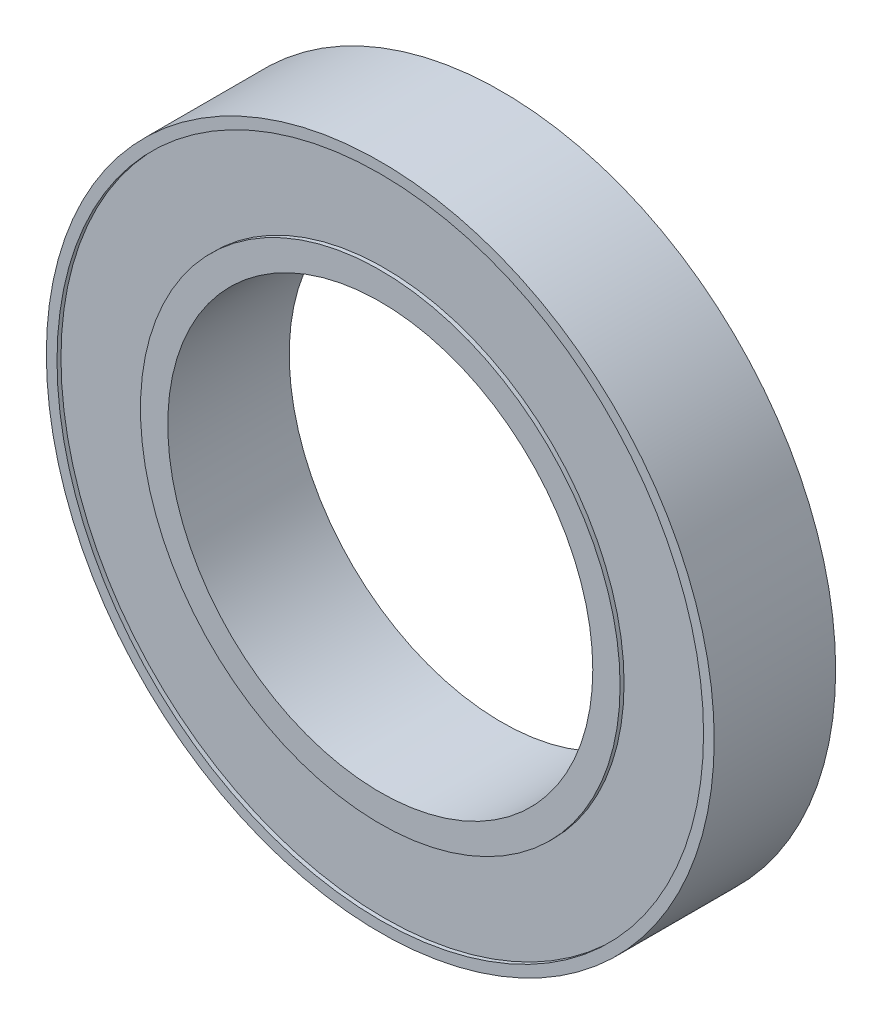
ISO-10303-21;
HEADER;
FILE_DESCRIPTION(('STEP AP214'),'2;1');
FILE_NAME('part.step','',(''),(''),'','','');
FILE_SCHEMA(('AUTOMOTIVE_DESIGN { 1 0 10303 214 1 1 1 1 }'));
ENDSEC;
DATA;
#1=APPLICATION_CONTEXT('core data for automotive mechanical design processes');
#2=APPLICATION_PROTOCOL_DEFINITION('international standard','automotive_design',2000,#1);
#3=PRODUCT_CONTEXT('',#1,'mechanical');
#4=PRODUCT('Part','Part','',(#3));
#5=PRODUCT_RELATED_PRODUCT_CATEGORY('part','',(#4));
#6=PRODUCT_DEFINITION_FORMATION('','',#4);
#7=PRODUCT_DEFINITION_CONTEXT('part definition',#1,'design');
#8=PRODUCT_DEFINITION('design','',#6,#7);
#9=PRODUCT_DEFINITION_SHAPE('','',#8);
#10=(LENGTH_UNIT() NAMED_UNIT(*) SI_UNIT(.MILLI.,.METRE.));
#11=(NAMED_UNIT(*) PLANE_ANGLE_UNIT() SI_UNIT($,.RADIAN.));
#12=(NAMED_UNIT(*) SI_UNIT($,.STERADIAN.) SOLID_ANGLE_UNIT());
#13=UNCERTAINTY_MEASURE_WITH_UNIT(LENGTH_MEASURE(1.E-05),#10,'distance_accuracy_value','');
#14=(GEOMETRIC_REPRESENTATION_CONTEXT(3) GLOBAL_UNCERTAINTY_ASSIGNED_CONTEXT((#13)) GLOBAL_UNIT_ASSIGNED_CONTEXT((#10,
#11,#12)) REPRESENTATION_CONTEXT('',''));
#15=CARTESIAN_POINT('',(0.,0.,0.));
#16=DIRECTION('',(0.,0.,1.));
#17=DIRECTION('',(1.,0.,0.));
#18=AXIS2_PLACEMENT_3D('',#15,#16,#17);
#19=CARTESIAN_POINT('',(17.5,0.,-5.));
#20=DIRECTION('',(0.,0.,-1.));
#21=DIRECTION('',(-1.,0.,0.));
#22=AXIS2_PLACEMENT_3D('',#19,#20,#21);
#23=PLANE('',#22);
#24=CARTESIAN_POINT('',(0.,0.,-5.));
#25=DIRECTION('',(0.,0.,1.));
#26=DIRECTION('',(1.,0.,0.));
#27=AXIS2_PLACEMENT_3D('',#24,#25,#26);
#28=CIRCLE('',#27,17.5);
#29=CARTESIAN_POINT('',(17.5,0.,-5.));
#30=VERTEX_POINT('',#29);
#31=EDGE_CURVE('E85',#30,#30,#28,.T.);
#32=ORIENTED_EDGE('',*,*,#31,.T.);
#33=EDGE_LOOP('',(#32));
#34=FACE_BOUND('',#33,.T.);
#35=CARTESIAN_POINT('',(0.,0.,-5.));
#36=DIRECTION('',(0.,0.,1.));
#37=DIRECTION('',(1.,0.,0.));
#38=AXIS2_PLACEMENT_3D('',#35,#36,#37);
#39=CIRCLE('',#38,19.7490722316571);
#40=CARTESIAN_POINT('',(19.7490722316571,0.,-5.));
#41=VERTEX_POINT('',#40);
#42=EDGE_CURVE('E10',#41,#41,#39,.T.);
#43=ORIENTED_EDGE('',*,*,#42,.F.);
#44=EDGE_LOOP('',(#43));
#45=FACE_BOUND('',#44,.T.);
#46=ADVANCED_FACE('F37',(#34,#45),#23,.T.);
#47=CARTESIAN_POINT('',(0.,0.,0.));
#48=DIRECTION('',(0.,0.,1.));
#49=DIRECTION('',(1.,0.,0.));
#50=AXIS2_PLACEMENT_3D('',#47,#48,#49);
#51=CYLINDRICAL_SURFACE('',#50,19.7490722316571);
#52=ORIENTED_EDGE('',*,*,#42,.T.);
#53=EDGE_LOOP('',(#52));
#54=FACE_BOUND('',#53,.T.);
#55=CARTESIAN_POINT('',(0.,0.,-4.6729794233355));
#56=DIRECTION('',(0.,0.,1.));
#57=DIRECTION('',(1.,0.,0.));
#58=AXIS2_PLACEMENT_3D('',#55,#56,#57);
#59=CIRCLE('',#58,19.7490722316571);
#60=CARTESIAN_POINT('',(19.7490722316571,0.,-4.6729794233355));
#61=VERTEX_POINT('',#60);
#62=EDGE_CURVE('E43',#61,#61,#59,.T.);
#63=ORIENTED_EDGE('',*,*,#62,.F.);
#64=EDGE_LOOP('',(#63));
#65=FACE_BOUND('',#64,.T.);
#66=ADVANCED_FACE('F105',(#54,#65),#51,.T.);
#67=CARTESIAN_POINT('',(19.7490722316571,0.,-4.6729794233355));
#68=DIRECTION('',(0.,0.,-1.));
#69=DIRECTION('',(-1.,0.,0.));
#70=AXIS2_PLACEMENT_3D('',#67,#68,#69);
#71=PLANE('',#70);
#72=ORIENTED_EDGE('',*,*,#62,.T.);
#73=EDGE_LOOP('',(#72));
#74=FACE_BOUND('',#73,.T.);
#75=CARTESIAN_POINT('',(0.,0.,-4.6729794233355));
#76=DIRECTION('',(0.,0.,1.));
#77=DIRECTION('',(1.,0.,0.));
#78=AXIS2_PLACEMENT_3D('',#75,#76,#77);
#79=CIRCLE('',#78,26.6210192290424);
#80=CARTESIAN_POINT('',(26.6210192290424,0.,-4.6729794233355));
#81=VERTEX_POINT('',#80);
#82=EDGE_CURVE('E47',#81,#81,#79,.T.);
#83=ORIENTED_EDGE('',*,*,#82,.F.);
#84=EDGE_LOOP('',(#83));
#85=FACE_BOUND('',#84,.T.);
#86=ADVANCED_FACE('F109',(#74,#85),#71,.T.);
#87=CARTESIAN_POINT('',(0.,0.,0.));
#88=DIRECTION('',(0.,0.,1.));
#89=DIRECTION('',(1.,0.,0.));
#90=AXIS2_PLACEMENT_3D('',#87,#88,#89);
#91=CYLINDRICAL_SURFACE('',#90,26.6210192290424);
#92=ORIENTED_EDGE('',*,*,#82,.T.);
#93=EDGE_LOOP('',(#92));
#94=FACE_BOUND('',#93,.T.);
#95=CARTESIAN_POINT('',(0.,0.,-5.));
#96=DIRECTION('',(0.,0.,1.));
#97=DIRECTION('',(1.,0.,0.));
#98=AXIS2_PLACEMENT_3D('',#95,#96,#97);
#99=CIRCLE('',#98,26.6210192290424);
#100=CARTESIAN_POINT('',(26.6210192290424,0.,-5.));
#101=VERTEX_POINT('',#100);
#102=EDGE_CURVE('E52',#101,#101,#99,.T.);
#103=ORIENTED_EDGE('',*,*,#102,.F.);
#104=EDGE_LOOP('',(#103));
#105=FACE_BOUND('',#104,.T.);
#106=ADVANCED_FACE('F113',(#94,#105),#91,.F.);
#107=CARTESIAN_POINT('',(26.6210192290424,0.,-5.));
#108=DIRECTION('',(0.,0.,-1.));
#109=DIRECTION('',(-1.,0.,0.));
#110=AXIS2_PLACEMENT_3D('',#107,#108,#109);
#111=PLANE('',#110);
#112=ORIENTED_EDGE('',*,*,#102,.T.);
#113=EDGE_LOOP('',(#112));
#114=FACE_BOUND('',#113,.T.);
#115=CARTESIAN_POINT('',(0.,0.,-5.));
#116=DIRECTION('',(0.,0.,1.));
#117=DIRECTION('',(1.,0.,0.));
#118=AXIS2_PLACEMENT_3D('',#115,#116,#117);
#119=CIRCLE('',#118,27.5);
#120=CARTESIAN_POINT('',(27.5,0.,-5.));
#121=VERTEX_POINT('',#120);
#122=EDGE_CURVE('E57',#121,#121,#119,.T.);
#123=ORIENTED_EDGE('',*,*,#122,.F.);
#124=EDGE_LOOP('',(#123));
#125=FACE_BOUND('',#124,.T.);
#126=ADVANCED_FACE('F119',(#114,#125),#111,.T.);
#127=CARTESIAN_POINT('',(0.,0.,0.));
#128=DIRECTION('',(0.,0.,1.));
#129=DIRECTION('',(1.,0.,0.));
#130=AXIS2_PLACEMENT_3D('',#127,#128,#129);
#131=CYLINDRICAL_SURFACE('',#130,27.5);
#132=ORIENTED_EDGE('',*,*,#122,.T.);
#133=EDGE_LOOP('',(#132));
#134=FACE_BOUND('',#133,.T.);
#135=CARTESIAN_POINT('',(0.,0.,5.));
#136=DIRECTION('',(0.,0.,1.));
#137=DIRECTION('',(1.,0.,0.));
#138=AXIS2_PLACEMENT_3D('',#135,#136,#137);
#139=CIRCLE('',#138,27.5);
#140=CARTESIAN_POINT('',(27.5,0.,5.));
#141=VERTEX_POINT('',#140);
#142=EDGE_CURVE('E61',#141,#141,#139,.T.);
#143=ORIENTED_EDGE('',*,*,#142,.F.);
#144=EDGE_LOOP('',(#143));
#145=FACE_BOUND('',#144,.T.);
#146=ADVANCED_FACE('F123',(#134,#145),#131,.T.);
#147=CARTESIAN_POINT('',(26.6210192290424,0.,5.));
#148=DIRECTION('',(0.,0.,1.));
#149=DIRECTION('',(1.,0.,0.));
#150=AXIS2_PLACEMENT_3D('',#147,#148,#149);
#151=PLANE('',#150);
#152=ORIENTED_EDGE('',*,*,#142,.T.);
#153=EDGE_LOOP('',(#152));
#154=FACE_BOUND('',#153,.T.);
#155=CARTESIAN_POINT('',(0.,0.,5.));
#156=DIRECTION('',(0.,0.,1.));
#157=DIRECTION('',(1.,0.,0.));
#158=AXIS2_PLACEMENT_3D('',#155,#156,#157);
#159=CIRCLE('',#158,26.6210192290424);
#160=CARTESIAN_POINT('',(26.6210192290424,0.,5.));
#161=VERTEX_POINT('',#160);
#162=EDGE_CURVE('E65',#161,#161,#159,.T.);
#163=ORIENTED_EDGE('',*,*,#162,.F.);
#164=EDGE_LOOP('',(#163));
#165=FACE_BOUND('',#164,.T.);
#166=ADVANCED_FACE('F127',(#154,#165),#151,.T.);
#167=CARTESIAN_POINT('',(0.,0.,0.));
#168=DIRECTION('',(0.,0.,1.));
#169=DIRECTION('',(1.,0.,0.));
#170=AXIS2_PLACEMENT_3D('',#167,#168,#169);
#171=CYLINDRICAL_SURFACE('',#170,26.6210192290424);
#172=ORIENTED_EDGE('',*,*,#162,.T.);
#173=EDGE_LOOP('',(#172));
#174=FACE_BOUND('',#173,.T.);
#175=CARTESIAN_POINT('',(0.,0.,4.6729794233355));
#176=DIRECTION('',(0.,0.,1.));
#177=DIRECTION('',(1.,0.,0.));
#178=AXIS2_PLACEMENT_3D('',#175,#176,#177);
#179=CIRCLE('',#178,26.6210192290424);
#180=CARTESIAN_POINT('',(26.6210192290424,0.,4.6729794233355));
#181=VERTEX_POINT('',#180);
#182=EDGE_CURVE('E69',#181,#181,#179,.T.);
#183=ORIENTED_EDGE('',*,*,#182,.F.);
#184=EDGE_LOOP('',(#183));
#185=FACE_BOUND('',#184,.T.);
#186=ADVANCED_FACE('F131',(#174,#185),#171,.F.);
#187=CARTESIAN_POINT('',(19.7490722316571,0.,4.6729794233355));
#188=DIRECTION('',(0.,0.,1.));
#189=DIRECTION('',(1.,0.,0.));
#190=AXIS2_PLACEMENT_3D('',#187,#188,#189);
#191=PLANE('',#190);
#192=ORIENTED_EDGE('',*,*,#182,.T.);
#193=EDGE_LOOP('',(#192));
#194=FACE_BOUND('',#193,.T.);
#195=CARTESIAN_POINT('',(0.,0.,4.6729794233355));
#196=DIRECTION('',(0.,0.,1.));
#197=DIRECTION('',(1.,0.,0.));
#198=AXIS2_PLACEMENT_3D('',#195,#196,#197);
#199=CIRCLE('',#198,19.7490722316571);
#200=CARTESIAN_POINT('',(19.7490722316571,0.,4.6729794233355));
#201=VERTEX_POINT('',#200);
#202=EDGE_CURVE('E73',#201,#201,#199,.T.);
#203=ORIENTED_EDGE('',*,*,#202,.F.);
#204=EDGE_LOOP('',(#203));
#205=FACE_BOUND('',#204,.T.);
#206=ADVANCED_FACE('F135',(#194,#205),#191,.T.);
#207=CARTESIAN_POINT('',(0.,0.,0.));
#208=DIRECTION('',(0.,0.,1.));
#209=DIRECTION('',(1.,0.,0.));
#210=AXIS2_PLACEMENT_3D('',#207,#208,#209);
#211=CYLINDRICAL_SURFACE('',#210,19.7490722316571);
#212=ORIENTED_EDGE('',*,*,#202,.T.);
#213=EDGE_LOOP('',(#212));
#214=FACE_BOUND('',#213,.T.);
#215=CARTESIAN_POINT('',(0.,0.,5.));
#216=DIRECTION('',(0.,0.,1.));
#217=DIRECTION('',(1.,0.,0.));
#218=AXIS2_PLACEMENT_3D('',#215,#216,#217);
#219=CIRCLE('',#218,19.7490722316571);
#220=CARTESIAN_POINT('',(19.7490722316571,0.,5.));
#221=VERTEX_POINT('',#220);
#222=EDGE_CURVE('E77',#221,#221,#219,.T.);
#223=ORIENTED_EDGE('',*,*,#222,.F.);
#224=EDGE_LOOP('',(#223));
#225=FACE_BOUND('',#224,.T.);
#226=ADVANCED_FACE('F102',(#214,#225),#211,.T.);
#227=CARTESIAN_POINT('',(17.5,0.,5.));
#228=DIRECTION('',(0.,0.,1.));
#229=DIRECTION('',(1.,0.,0.));
#230=AXIS2_PLACEMENT_3D('',#227,#228,#229);
#231=PLANE('',#230);
#232=ORIENTED_EDGE('',*,*,#222,.T.);
#233=EDGE_LOOP('',(#232));
#234=FACE_BOUND('',#233,.T.);
#235=CARTESIAN_POINT('',(0.,0.,5.));
#236=DIRECTION('',(0.,0.,1.));
#237=DIRECTION('',(1.,0.,0.));
#238=AXIS2_PLACEMENT_3D('',#235,#236,#237);
#239=CIRCLE('',#238,17.5);
#240=CARTESIAN_POINT('',(17.5,0.,5.));
#241=VERTEX_POINT('',#240);
#242=EDGE_CURVE('E81',#241,#241,#239,.T.);
#243=ORIENTED_EDGE('',*,*,#242,.F.);
#244=EDGE_LOOP('',(#243));
#245=FACE_BOUND('',#244,.T.);
#246=ADVANCED_FACE('F96',(#234,#245),#231,.T.);
#247=CARTESIAN_POINT('',(0.,0.,0.));
#248=DIRECTION('',(0.,0.,1.));
#249=DIRECTION('',(1.,0.,0.));
#250=AXIS2_PLACEMENT_3D('',#247,#248,#249);
#251=CYLINDRICAL_SURFACE('',#250,17.5);
#252=ORIENTED_EDGE('',*,*,#242,.T.);
#253=EDGE_LOOP('',(#252));
#254=FACE_BOUND('',#253,.T.);
#255=ORIENTED_EDGE('',*,*,#31,.F.);
#256=EDGE_LOOP('',(#255));
#257=FACE_BOUND('',#256,.T.);
#258=ADVANCED_FACE('F94',(#254,#257),#251,.F.);
#259=CLOSED_SHELL('',(#46,#66,#86,#106,#126,#146,#166,#186,#206,#226,#246,#258));
#260=MANIFOLD_SOLID_BREP('B2',#259);
#261=ADVANCED_BREP_SHAPE_REPRESENTATION('',(#18,#260),#14);
#262=SHAPE_DEFINITION_REPRESENTATION(#9,#261);
ENDSEC;
END-ISO-10303-21;
